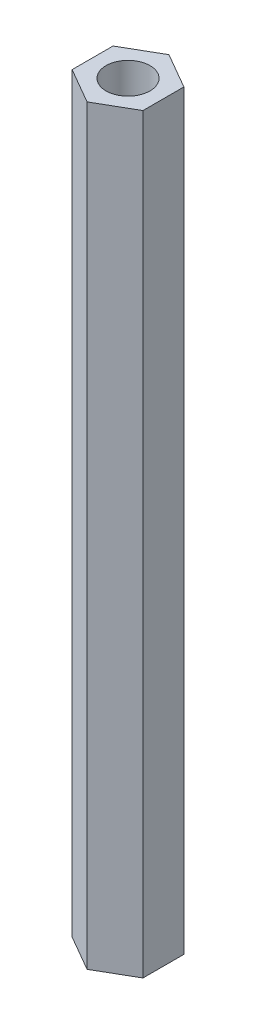
ISO-10303-21;
HEADER;
FILE_DESCRIPTION(('STEP AP214'),'2;1');
FILE_NAME('part.step','',(''),(''),'','','');
FILE_SCHEMA(('AUTOMOTIVE_DESIGN { 1 0 10303 214 1 1 1 1 }'));
ENDSEC;
DATA;
#1=APPLICATION_CONTEXT('core data for automotive mechanical design processes');
#2=APPLICATION_PROTOCOL_DEFINITION('international standard','automotive_design',2000,#1);
#3=PRODUCT_CONTEXT('',#1,'mechanical');
#4=PRODUCT('Part','Part','',(#3));
#5=PRODUCT_RELATED_PRODUCT_CATEGORY('part','',(#4));
#6=PRODUCT_DEFINITION_FORMATION('','',#4);
#7=PRODUCT_DEFINITION_CONTEXT('part definition',#1,'design');
#8=PRODUCT_DEFINITION('design','',#6,#7);
#9=PRODUCT_DEFINITION_SHAPE('','',#8);
#10=(LENGTH_UNIT() NAMED_UNIT(*) SI_UNIT(.MILLI.,.METRE.));
#11=(NAMED_UNIT(*) PLANE_ANGLE_UNIT() SI_UNIT($,.RADIAN.));
#12=(NAMED_UNIT(*) SI_UNIT($,.STERADIAN.) SOLID_ANGLE_UNIT());
#13=UNCERTAINTY_MEASURE_WITH_UNIT(LENGTH_MEASURE(1.E-05),#10,'distance_accuracy_value','');
#14=(GEOMETRIC_REPRESENTATION_CONTEXT(3) GLOBAL_UNCERTAINTY_ASSIGNED_CONTEXT((#13)) GLOBAL_UNIT_ASSIGNED_CONTEXT((#10,
#11,#12)) REPRESENTATION_CONTEXT('',''));
#15=CARTESIAN_POINT('',(0.,0.,0.));
#16=DIRECTION('',(0.,0.,1.));
#17=DIRECTION('',(1.,0.,0.));
#18=AXIS2_PLACEMENT_3D('',#15,#16,#17);
#19=CARTESIAN_POINT('',(0.,53.,0.));
#20=DIRECTION('',(0.,1.,0.));
#21=DIRECTION('',(0.,0.,1.));
#22=AXIS2_PLACEMENT_3D('',#19,#20,#21);
#23=PLANE('',#22);
#24=DIRECTION('',(0.866025403784442,0.,0.499999999999995));
#25=VECTOR('',#24,1.);
#26=CARTESIAN_POINT('',(-2.49999999999999,53.,1.44337567297409));
#27=LINE('',#26,#25);
#28=CARTESIAN_POINT('',(-2.49999999999999,53.,1.44337567297409));
#29=VERTEX_POINT('',#28);
#30=CARTESIAN_POINT('',(0.,53.,2.88675134594813));
#31=VERTEX_POINT('',#30);
#32=EDGE_CURVE('E131',#29,#31,#27,.T.);
#33=ORIENTED_EDGE('',*,*,#32,.T.);
#34=DIRECTION('',(0.866025403784438,0.,-0.500000000000001));
#35=VECTOR('',#34,1.);
#36=CARTESIAN_POINT('',(0.,53.,2.88675134594813));
#37=LINE('',#36,#35);
#38=CARTESIAN_POINT('',(2.50000000000001,53.,1.44337567297406));
#39=VERTEX_POINT('',#38);
#40=EDGE_CURVE('E89',#31,#39,#37,.T.);
#41=ORIENTED_EDGE('',*,*,#40,.T.);
#42=DIRECTION('',(0.,0.,-1.));
#43=VECTOR('',#42,1.);
#44=CARTESIAN_POINT('',(2.50000000000001,53.,1.44337567297406));
#45=LINE('',#44,#43);
#46=CARTESIAN_POINT('',(2.5,53.,-1.44337567297408));
#47=VERTEX_POINT('',#46);
#48=EDGE_CURVE('E102',#39,#47,#45,.T.);
#49=ORIENTED_EDGE('',*,*,#48,.T.);
#50=DIRECTION('',(-0.866025403784441,0.,-0.499999999999995));
#51=VECTOR('',#50,1.);
#52=CARTESIAN_POINT('',(2.5,53.,-1.44337567297408));
#53=LINE('',#52,#51);
#54=CARTESIAN_POINT('',(0.,53.,-2.88675134594813));
#55=VERTEX_POINT('',#54);
#56=EDGE_CURVE('E96',#47,#55,#53,.T.);
#57=ORIENTED_EDGE('',*,*,#56,.T.);
#58=DIRECTION('',(-0.866025403784435,0.,0.500000000000007));
#59=VECTOR('',#58,1.);
#60=CARTESIAN_POINT('',(0.,53.,-2.88675134594813));
#61=LINE('',#60,#59);
#62=CARTESIAN_POINT('',(-2.50000000000002,53.,-1.44337567297404));
#63=VERTEX_POINT('',#62);
#64=EDGE_CURVE('E100',#55,#63,#61,.T.);
#65=ORIENTED_EDGE('',*,*,#64,.T.);
#66=DIRECTION('',(0.,0.,1.));
#67=VECTOR('',#66,1.);
#68=CARTESIAN_POINT('',(-2.50000000000002,53.,-1.44337567297404));
#69=LINE('',#68,#67);
#70=EDGE_CURVE('E52',#63,#29,#69,.T.);
#71=ORIENTED_EDGE('',*,*,#70,.T.);
#72=EDGE_LOOP('',(#33,#41,#49,#57,#65,#71));
#73=FACE_BOUND('',#72,.T.);
#74=CARTESIAN_POINT('',(0.,53.,0.));
#75=DIRECTION('',(0.,1.,0.));
#76=DIRECTION('',(0.,0.,1.));
#77=AXIS2_PLACEMENT_3D('',#74,#75,#76);
#78=CIRCLE('',#77,1.55);
#79=CARTESIAN_POINT('',(0.,53.,1.55));
#80=VERTEX_POINT('',#79);
#81=EDGE_CURVE('E124',#80,#80,#78,.T.);
#82=ORIENTED_EDGE('',*,*,#81,.F.);
#83=EDGE_LOOP('',(#82));
#84=FACE_BOUND('',#83,.T.);
#85=ADVANCED_FACE('F35',(#73,#84),#23,.T.);
#86=CARTESIAN_POINT('',(0.,0.,0.));
#87=DIRECTION('',(0.,1.,0.));
#88=DIRECTION('',(0.,0.,1.));
#89=AXIS2_PLACEMENT_3D('',#86,#87,#88);
#90=PLANE('',#89);
#91=DIRECTION('',(0.866025403784442,0.,0.499999999999995));
#92=VECTOR('',#91,1.);
#93=CARTESIAN_POINT('',(-2.49999999999999,0.,1.44337567297409));
#94=LINE('',#93,#92);
#95=CARTESIAN_POINT('',(-2.49999999999999,0.,1.44337567297409));
#96=VERTEX_POINT('',#95);
#97=CARTESIAN_POINT('',(0.,0.,2.88675134594813));
#98=VERTEX_POINT('',#97);
#99=EDGE_CURVE('E120',#96,#98,#94,.T.);
#100=ORIENTED_EDGE('',*,*,#99,.F.);
#101=DIRECTION('',(0.,0.,1.));
#102=VECTOR('',#101,1.);
#103=CARTESIAN_POINT('',(-2.50000000000002,0.,-1.44337567297404));
#104=LINE('',#103,#102);
#105=CARTESIAN_POINT('',(-2.50000000000002,0.,-1.44337567297404));
#106=VERTEX_POINT('',#105);
#107=EDGE_CURVE('E81',#106,#96,#104,.T.);
#108=ORIENTED_EDGE('',*,*,#107,.F.);
#109=DIRECTION('',(-0.866025403784435,0.,0.500000000000007));
#110=VECTOR('',#109,1.);
#111=CARTESIAN_POINT('',(0.,0.,-2.88675134594813));
#112=LINE('',#111,#110);
#113=CARTESIAN_POINT('',(0.,0.,-2.88675134594813));
#114=VERTEX_POINT('',#113);
#115=EDGE_CURVE('E75',#114,#106,#112,.T.);
#116=ORIENTED_EDGE('',*,*,#115,.F.);
#117=DIRECTION('',(-0.866025403784441,0.,-0.499999999999995));
#118=VECTOR('',#117,1.);
#119=CARTESIAN_POINT('',(2.5,0.,-1.44337567297408));
#120=LINE('',#119,#118);
#121=CARTESIAN_POINT('',(2.5,0.,-1.44337567297408));
#122=VERTEX_POINT('',#121);
#123=EDGE_CURVE('E110',#122,#114,#120,.T.);
#124=ORIENTED_EDGE('',*,*,#123,.F.);
#125=DIRECTION('',(0.,0.,-1.));
#126=VECTOR('',#125,1.);
#127=CARTESIAN_POINT('',(2.50000000000001,0.,1.44337567297406));
#128=LINE('',#127,#126);
#129=CARTESIAN_POINT('',(2.50000000000001,0.,1.44337567297406));
#130=VERTEX_POINT('',#129);
#131=EDGE_CURVE('E126',#130,#122,#128,.T.);
#132=ORIENTED_EDGE('',*,*,#131,.F.);
#133=DIRECTION('',(0.866025403784438,0.,-0.500000000000001));
#134=VECTOR('',#133,1.);
#135=CARTESIAN_POINT('',(0.,0.,2.88675134594813));
#136=LINE('',#135,#134);
#137=EDGE_CURVE('E123',#98,#130,#136,.T.);
#138=ORIENTED_EDGE('',*,*,#137,.F.);
#139=EDGE_LOOP('',(#100,#108,#116,#124,#132,#138));
#140=FACE_BOUND('',#139,.T.);
#141=CARTESIAN_POINT('',(0.,0.,0.));
#142=DIRECTION('',(0.,1.,0.));
#143=DIRECTION('',(0.,0.,1.));
#144=AXIS2_PLACEMENT_3D('',#141,#142,#143);
#145=CIRCLE('',#144,1.55);
#146=CARTESIAN_POINT('',(0.,0.,1.55));
#147=VERTEX_POINT('',#146);
#148=EDGE_CURVE('E224',#147,#147,#145,.T.);
#149=ORIENTED_EDGE('',*,*,#148,.T.);
#150=EDGE_LOOP('',(#149));
#151=FACE_BOUND('',#150,.T.);
#152=ADVANCED_FACE('F140',(#140,#151),#90,.F.);
#153=CARTESIAN_POINT('',(-2.49999999999999,53.,1.44337567297409));
#154=DIRECTION('',(0.499999999999995,0.,-0.866025403784442));
#155=DIRECTION('',(-0.866025403784442,0.,-0.499999999999995));
#156=AXIS2_PLACEMENT_3D('',#153,#154,#155);
#157=PLANE('',#156);
#158=ORIENTED_EDGE('',*,*,#99,.T.);
#159=DIRECTION('',(0.,-1.,0.));
#160=VECTOR('',#159,1.);
#161=CARTESIAN_POINT('',(0.,53.,2.88675134594813));
#162=LINE('',#161,#160);
#163=EDGE_CURVE('E11',#31,#98,#162,.T.);
#164=ORIENTED_EDGE('',*,*,#163,.F.);
#165=ORIENTED_EDGE('',*,*,#32,.F.);
#166=DIRECTION('',(0.,-1.,0.));
#167=VECTOR('',#166,1.);
#168=CARTESIAN_POINT('',(-2.49999999999999,53.,1.44337567297409));
#169=LINE('',#168,#167);
#170=EDGE_CURVE('E116',#29,#96,#169,.T.);
#171=ORIENTED_EDGE('',*,*,#170,.T.);
#172=EDGE_LOOP('',(#158,#164,#165,#171));
#173=FACE_BOUND('',#172,.T.);
#174=ADVANCED_FACE('F37',(#173),#157,.F.);
#175=CARTESIAN_POINT('',(0.,53.,2.88675134594813));
#176=DIRECTION('',(-0.500000000000001,0.,-0.866025403784438));
#177=DIRECTION('',(-0.866025403784438,0.,0.500000000000001));
#178=AXIS2_PLACEMENT_3D('',#175,#176,#177);
#179=PLANE('',#178);
#180=ORIENTED_EDGE('',*,*,#137,.T.);
#181=DIRECTION('',(0.,-1.,0.));
#182=VECTOR('',#181,1.);
#183=CARTESIAN_POINT('',(2.50000000000001,53.,1.44337567297406));
#184=LINE('',#183,#182);
#185=EDGE_CURVE('E44',#39,#130,#184,.T.);
#186=ORIENTED_EDGE('',*,*,#185,.F.);
#187=ORIENTED_EDGE('',*,*,#40,.F.);
#188=ORIENTED_EDGE('',*,*,#163,.T.);
#189=EDGE_LOOP('',(#180,#186,#187,#188));
#190=FACE_BOUND('',#189,.T.);
#191=ADVANCED_FACE('F165',(#190),#179,.F.);
#192=CARTESIAN_POINT('',(2.50000000000001,53.,1.44337567297406));
#193=DIRECTION('',(-1.,0.,0.));
#194=DIRECTION('',(0.,0.,1.));
#195=AXIS2_PLACEMENT_3D('',#192,#193,#194);
#196=PLANE('',#195);
#197=ORIENTED_EDGE('',*,*,#131,.T.);
#198=DIRECTION('',(0.,-1.,0.));
#199=VECTOR('',#198,1.);
#200=CARTESIAN_POINT('',(2.5,53.,-1.44337567297408));
#201=LINE('',#200,#199);
#202=EDGE_CURVE('E111',#47,#122,#201,.T.);
#203=ORIENTED_EDGE('',*,*,#202,.F.);
#204=ORIENTED_EDGE('',*,*,#48,.F.);
#205=ORIENTED_EDGE('',*,*,#185,.T.);
#206=EDGE_LOOP('',(#197,#203,#204,#205));
#207=FACE_BOUND('',#206,.T.);
#208=ADVANCED_FACE('F137',(#207),#196,.F.);
#209=CARTESIAN_POINT('',(2.5,53.,-1.44337567297408));
#210=DIRECTION('',(-0.499999999999995,0.,0.866025403784442));
#211=DIRECTION('',(0.866025403784442,0.,0.499999999999995));
#212=AXIS2_PLACEMENT_3D('',#209,#210,#211);
#213=PLANE('',#212);
#214=ORIENTED_EDGE('',*,*,#123,.T.);
#215=DIRECTION('',(0.,-1.,0.));
#216=VECTOR('',#215,1.);
#217=CARTESIAN_POINT('',(0.,53.,-2.88675134594813));
#218=LINE('',#217,#216);
#219=EDGE_CURVE('E107',#55,#114,#218,.T.);
#220=ORIENTED_EDGE('',*,*,#219,.F.);
#221=ORIENTED_EDGE('',*,*,#56,.F.);
#222=ORIENTED_EDGE('',*,*,#202,.T.);
#223=EDGE_LOOP('',(#214,#220,#221,#222));
#224=FACE_BOUND('',#223,.T.);
#225=ADVANCED_FACE('F108',(#224),#213,.F.);
#226=CARTESIAN_POINT('',(0.,53.,-2.88675134594813));
#227=DIRECTION('',(0.500000000000007,0.,0.866025403784435));
#228=DIRECTION('',(0.866025403784435,0.,-0.500000000000007));
#229=AXIS2_PLACEMENT_3D('',#226,#227,#228);
#230=PLANE('',#229);
#231=ORIENTED_EDGE('',*,*,#115,.T.);
#232=DIRECTION('',(0.,-1.,0.));
#233=VECTOR('',#232,1.);
#234=CARTESIAN_POINT('',(-2.50000000000002,53.,-1.44337567297404));
#235=LINE('',#234,#233);
#236=EDGE_CURVE('E112',#63,#106,#235,.T.);
#237=ORIENTED_EDGE('',*,*,#236,.F.);
#238=ORIENTED_EDGE('',*,*,#64,.F.);
#239=ORIENTED_EDGE('',*,*,#219,.T.);
#240=EDGE_LOOP('',(#231,#237,#238,#239));
#241=FACE_BOUND('',#240,.T.);
#242=ADVANCED_FACE('F114',(#241),#230,.F.);
#243=CARTESIAN_POINT('',(-2.50000000000002,53.,-1.44337567297404));
#244=DIRECTION('',(1.,0.,0.));
#245=DIRECTION('',(0.,0.,-1.));
#246=AXIS2_PLACEMENT_3D('',#243,#244,#245);
#247=PLANE('',#246);
#248=ORIENTED_EDGE('',*,*,#107,.T.);
#249=ORIENTED_EDGE('',*,*,#170,.F.);
#250=ORIENTED_EDGE('',*,*,#70,.F.);
#251=ORIENTED_EDGE('',*,*,#236,.T.);
#252=EDGE_LOOP('',(#248,#249,#250,#251));
#253=FACE_BOUND('',#252,.T.);
#254=ADVANCED_FACE('F145',(#253),#247,.F.);
#255=CARTESIAN_POINT('',(0.,53.,0.));
#256=DIRECTION('',(0.,-1.,0.));
#257=DIRECTION('',(0.,0.,-1.));
#258=AXIS2_PLACEMENT_3D('',#255,#256,#257);
#259=CYLINDRICAL_SURFACE('',#258,1.55);
#260=ORIENTED_EDGE('',*,*,#81,.T.);
#261=EDGE_LOOP('',(#260));
#262=FACE_BOUND('',#261,.T.);
#263=ORIENTED_EDGE('',*,*,#148,.F.);
#264=EDGE_LOOP('',(#263));
#265=FACE_BOUND('',#264,.T.);
#266=ADVANCED_FACE('F147',(#262,#265),#259,.F.);
#267=CLOSED_SHELL('',(#85,#152,#174,#191,#208,#225,#242,#254,#266));
#268=MANIFOLD_SOLID_BREP('B2',#267);
#269=ADVANCED_BREP_SHAPE_REPRESENTATION('',(#18,#268),#14);
#270=SHAPE_DEFINITION_REPRESENTATION(#9,#269);
ENDSEC;
END-ISO-10303-21;
